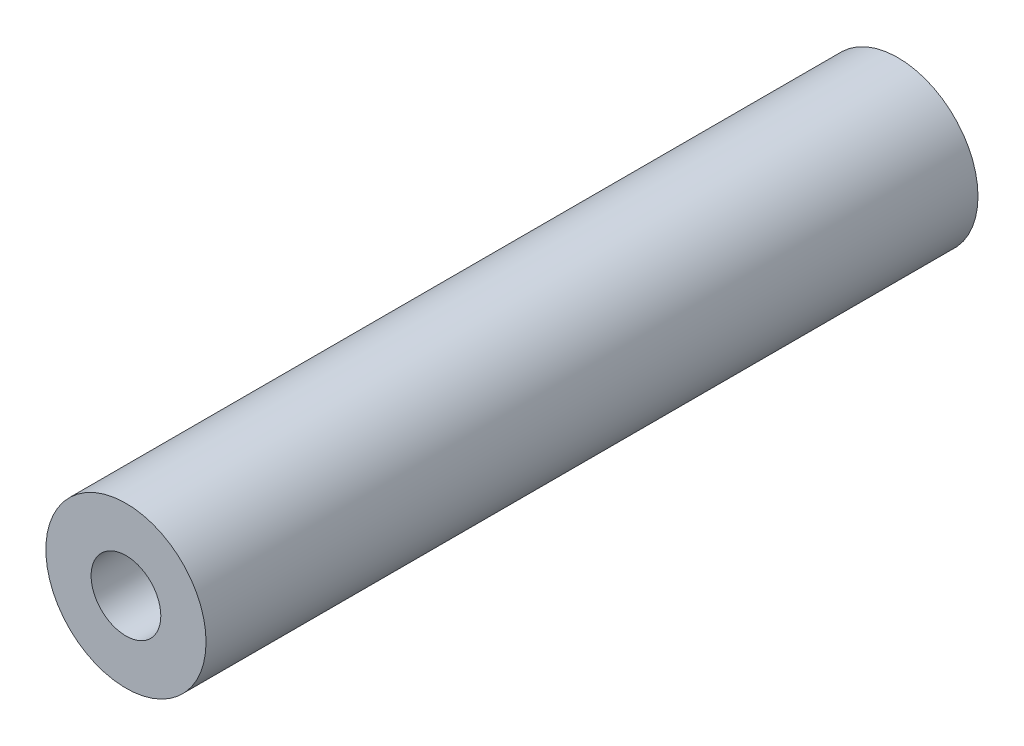
ISO-10303-21;
HEADER;
FILE_DESCRIPTION(('STEP AP214'),'2;1');
FILE_NAME('part.step','',(''),(''),'','','');
FILE_SCHEMA(('AUTOMOTIVE_DESIGN { 1 0 10303 214 1 1 1 1 }'));
ENDSEC;
DATA;
#1=APPLICATION_CONTEXT('core data for automotive mechanical design processes');
#2=APPLICATION_PROTOCOL_DEFINITION('international standard','automotive_design',2000,#1);
#3=PRODUCT_CONTEXT('',#1,'mechanical');
#4=PRODUCT('Part','Part','',(#3));
#5=PRODUCT_RELATED_PRODUCT_CATEGORY('part','',(#4));
#6=PRODUCT_DEFINITION_FORMATION('','',#4);
#7=PRODUCT_DEFINITION_CONTEXT('part definition',#1,'design');
#8=PRODUCT_DEFINITION('design','',#6,#7);
#9=PRODUCT_DEFINITION_SHAPE('','',#8);
#10=(LENGTH_UNIT() NAMED_UNIT(*) SI_UNIT(.MILLI.,.METRE.));
#11=(NAMED_UNIT(*) PLANE_ANGLE_UNIT() SI_UNIT($,.RADIAN.));
#12=(NAMED_UNIT(*) SI_UNIT($,.STERADIAN.) SOLID_ANGLE_UNIT());
#13=UNCERTAINTY_MEASURE_WITH_UNIT(LENGTH_MEASURE(1.E-05),#10,'distance_accuracy_value','');
#14=(GEOMETRIC_REPRESENTATION_CONTEXT(3) GLOBAL_UNCERTAINTY_ASSIGNED_CONTEXT((#13)) GLOBAL_UNIT_ASSIGNED_CONTEXT((#10,
#11,#12)) REPRESENTATION_CONTEXT('',''));
#15=CARTESIAN_POINT('',(0.,0.,0.));
#16=DIRECTION('',(0.,0.,1.));
#17=DIRECTION('',(1.,0.,0.));
#18=AXIS2_PLACEMENT_3D('',#15,#16,#17);
#19=CARTESIAN_POINT('',(0.,0.,130.));
#20=DIRECTION('',(0.,0.,1.));
#21=DIRECTION('',(1.,0.,0.));
#22=AXIS2_PLACEMENT_3D('',#19,#20,#21);
#23=PLANE('',#22);
#24=CARTESIAN_POINT('',(0.,0.,130.));
#25=DIRECTION('',(0.,0.,1.));
#26=DIRECTION('',(1.,0.,0.));
#27=AXIS2_PLACEMENT_3D('',#24,#25,#26);
#28=CIRCLE('',#27,13.49);
#29=CARTESIAN_POINT('',(13.49,0.,130.));
#30=VERTEX_POINT('',#29);
#31=EDGE_CURVE('E10',#30,#30,#28,.T.);
#32=ORIENTED_EDGE('',*,*,#31,.T.);
#33=EDGE_LOOP('',(#32));
#34=FACE_BOUND('',#33,.T.);
#35=CARTESIAN_POINT('',(0.,0.,130.));
#36=DIRECTION('',(0.,0.,1.));
#37=DIRECTION('',(1.,0.,0.));
#38=AXIS2_PLACEMENT_3D('',#35,#36,#37);
#39=CIRCLE('',#38,5.87);
#40=CARTESIAN_POINT('',(5.87,0.,130.));
#41=VERTEX_POINT('',#40);
#42=EDGE_CURVE('E46',#41,#41,#39,.T.);
#43=ORIENTED_EDGE('',*,*,#42,.F.);
#44=EDGE_LOOP('',(#43));
#45=FACE_BOUND('',#44,.T.);
#46=ADVANCED_FACE('F35',(#34,#45),#23,.T.);
#47=CARTESIAN_POINT('',(0.,0.,0.));
#48=DIRECTION('',(0.,0.,1.));
#49=DIRECTION('',(1.,0.,0.));
#50=AXIS2_PLACEMENT_3D('',#47,#48,#49);
#51=PLANE('',#50);
#52=CARTESIAN_POINT('',(0.,0.,0.));
#53=DIRECTION('',(0.,0.,1.));
#54=DIRECTION('',(1.,0.,0.));
#55=AXIS2_PLACEMENT_3D('',#52,#53,#54);
#56=CIRCLE('',#55,13.49);
#57=CARTESIAN_POINT('',(13.49,0.,0.));
#58=VERTEX_POINT('',#57);
#59=EDGE_CURVE('E39',#58,#58,#56,.T.);
#60=ORIENTED_EDGE('',*,*,#59,.F.);
#61=EDGE_LOOP('',(#60));
#62=FACE_BOUND('',#61,.T.);
#63=CARTESIAN_POINT('',(0.,0.,0.));
#64=DIRECTION('',(0.,0.,1.));
#65=DIRECTION('',(1.,0.,0.));
#66=AXIS2_PLACEMENT_3D('',#63,#64,#65);
#67=CIRCLE('',#66,5.87);
#68=CARTESIAN_POINT('',(5.87,0.,0.));
#69=VERTEX_POINT('',#68);
#70=EDGE_CURVE('E48',#69,#69,#67,.T.);
#71=ORIENTED_EDGE('',*,*,#70,.T.);
#72=EDGE_LOOP('',(#71));
#73=FACE_BOUND('',#72,.T.);
#74=ADVANCED_FACE('F58',(#62,#73),#51,.F.);
#75=CARTESIAN_POINT('',(0.,0.,130.));
#76=DIRECTION('',(0.,0.,-1.));
#77=DIRECTION('',(-1.,0.,0.));
#78=AXIS2_PLACEMENT_3D('',#75,#76,#77);
#79=CYLINDRICAL_SURFACE('',#78,13.49);
#80=ORIENTED_EDGE('',*,*,#31,.F.);
#81=EDGE_LOOP('',(#80));
#82=FACE_BOUND('',#81,.T.);
#83=ORIENTED_EDGE('',*,*,#59,.T.);
#84=EDGE_LOOP('',(#83));
#85=FACE_BOUND('',#84,.T.);
#86=ADVANCED_FACE('F37',(#82,#85),#79,.T.);
#87=CARTESIAN_POINT('',(0.,0.,130.));
#88=DIRECTION('',(0.,0.,-1.));
#89=DIRECTION('',(-1.,0.,0.));
#90=AXIS2_PLACEMENT_3D('',#87,#88,#89);
#91=CYLINDRICAL_SURFACE('',#90,5.87);
#92=ORIENTED_EDGE('',*,*,#42,.T.);
#93=EDGE_LOOP('',(#92));
#94=FACE_BOUND('',#93,.T.);
#95=ORIENTED_EDGE('',*,*,#70,.F.);
#96=EDGE_LOOP('',(#95));
#97=FACE_BOUND('',#96,.T.);
#98=ADVANCED_FACE('F54',(#94,#97),#91,.F.);
#99=CLOSED_SHELL('',(#46,#74,#86,#98));
#100=MANIFOLD_SOLID_BREP('B2',#99);
#101=ADVANCED_BREP_SHAPE_REPRESENTATION('',(#18,#100),#14);
#102=SHAPE_DEFINITION_REPRESENTATION(#9,#101);
ENDSEC;
END-ISO-10303-21;
